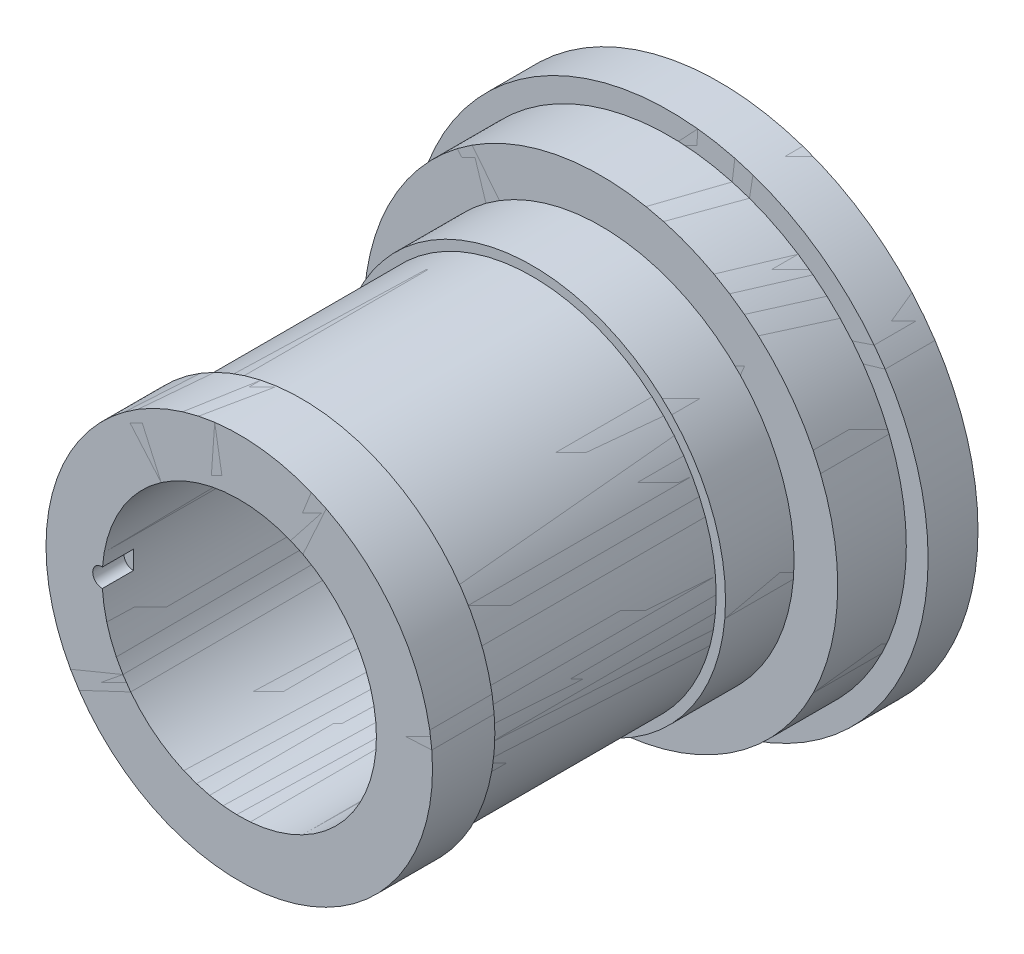
ISO-10303-21;
HEADER;
FILE_DESCRIPTION(('STEP AP214'),'2;1');
FILE_NAME('part.step','',(''),(''),'','','');
FILE_SCHEMA(('AUTOMOTIVE_DESIGN { 1 0 10303 214 1 1 1 1 }'));
ENDSEC;
DATA;
#1=APPLICATION_CONTEXT('core data for automotive mechanical design processes');
#2=APPLICATION_PROTOCOL_DEFINITION('international standard','automotive_design',2000,#1);
#3=PRODUCT_CONTEXT('',#1,'mechanical');
#4=PRODUCT('Part','Part','',(#3));
#5=PRODUCT_RELATED_PRODUCT_CATEGORY('part','',(#4));
#6=PRODUCT_DEFINITION_FORMATION('','',#4);
#7=PRODUCT_DEFINITION_CONTEXT('part definition',#1,'design');
#8=PRODUCT_DEFINITION('design','',#6,#7);
#9=PRODUCT_DEFINITION_SHAPE('','',#8);
#10=(LENGTH_UNIT() NAMED_UNIT(*) SI_UNIT(.MILLI.,.METRE.));
#11=(NAMED_UNIT(*) PLANE_ANGLE_UNIT() SI_UNIT($,.RADIAN.));
#12=(NAMED_UNIT(*) SI_UNIT($,.STERADIAN.) SOLID_ANGLE_UNIT());
#13=UNCERTAINTY_MEASURE_WITH_UNIT(LENGTH_MEASURE(1.E-05),#10,'distance_accuracy_value','');
#14=(GEOMETRIC_REPRESENTATION_CONTEXT(3) GLOBAL_UNCERTAINTY_ASSIGNED_CONTEXT((#13)) GLOBAL_UNIT_ASSIGNED_CONTEXT((#10,
#11,#12)) REPRESENTATION_CONTEXT('',''));
#15=CARTESIAN_POINT('',(0.,0.,0.));
#16=DIRECTION('',(0.,0.,1.));
#17=DIRECTION('',(1.,0.,0.));
#18=AXIS2_PLACEMENT_3D('',#15,#16,#17);
#19=CARTESIAN_POINT('',(-22.0000000000001,0.,-77.));
#20=DIRECTION('',(0.,0.,1.));
#21=DIRECTION('',(1.,0.,0.));
#22=AXIS2_PLACEMENT_3D('',#19,#20,#21);
#23=PLANE('',#22);
#24=CARTESIAN_POINT('',(0.,0.,-77.));
#25=DIRECTION('',(0.,0.,1.));
#26=DIRECTION('',(1.,0.,0.));
#27=AXIS2_PLACEMENT_3D('',#24,#25,#26);
#28=CIRCLE('',#27,41.5);
#29=CARTESIAN_POINT('',(41.5000000000001,0.,-77.));
#30=VERTEX_POINT('',#29);
#31=EDGE_CURVE('E91',#30,#30,#28,.T.);
#32=ORIENTED_EDGE('',*,*,#31,.F.);
#33=EDGE_LOOP('',(#32));
#34=FACE_BOUND('',#33,.T.);
#35=CARTESIAN_POINT('',(0.,0.,-77.));
#36=DIRECTION('',(0.,0.,1.));
#37=DIRECTION('',(1.,0.,0.));
#38=AXIS2_PLACEMENT_3D('',#35,#36,#37);
#39=CIRCLE('',#38,22.);
#40=CARTESIAN_POINT('',(22.,0.,-77.));
#41=VERTEX_POINT('',#40);
#42=EDGE_CURVE('E14',#41,#41,#39,.T.);
#43=ORIENTED_EDGE('',*,*,#42,.T.);
#44=EDGE_LOOP('',(#43));
#45=FACE_BOUND('',#44,.T.);
#46=ADVANCED_FACE('F56',(#34,#45),#23,.F.);
#47=CARTESIAN_POINT('',(0.,0.,0.));
#48=DIRECTION('',(0.,0.,1.));
#49=DIRECTION('',(1.,0.,0.));
#50=AXIS2_PLACEMENT_3D('',#47,#48,#49);
#51=CYLINDRICAL_SURFACE('',#50,22.);
#52=ORIENTED_EDGE('',*,*,#42,.F.);
#53=EDGE_LOOP('',(#52));
#54=FACE_BOUND('',#53,.T.);
#55=CARTESIAN_POINT('',(0.,0.,-5.));
#56=DIRECTION('',(0.,0.,-1.));
#57=DIRECTION('',(1.,0.,0.));
#58=AXIS2_PLACEMENT_3D('',#55,#56,#57);
#59=CIRCLE('',#58,22.);
#60=CARTESIAN_POINT('',(-21.958526324268,-1.35023022719472,-4.99999999999999));
#61=VERTEX_POINT('',#60);
#62=CARTESIAN_POINT('',(-21.9382185648473,1.6475940643827,-4.99999999999999));
#63=VERTEX_POINT('',#62);
#64=EDGE_CURVE('E86',#61,#63,#59,.T.);
#65=ORIENTED_EDGE('',*,*,#64,.F.);
#66=DIRECTION('',(0.,0.,1.));
#67=VECTOR('',#66,1.);
#68=CARTESIAN_POINT('',(-21.958526324268,-1.35023022719472,-4.99999999999999));
#69=LINE('',#68,#67);
#70=CARTESIAN_POINT('',(-21.958526324268,-1.35023022719472,0.));
#71=VERTEX_POINT('',#70);
#72=EDGE_CURVE('E76',#61,#71,#69,.T.);
#73=ORIENTED_EDGE('',*,*,#72,.T.);
#74=CARTESIAN_POINT('',(0.,0.,0.));
#75=DIRECTION('',(0.,0.,1.));
#76=DIRECTION('',(1.,0.,0.));
#77=AXIS2_PLACEMENT_3D('',#74,#75,#76);
#78=CIRCLE('',#77,22.);
#79=CARTESIAN_POINT('',(-21.9382185648473,1.6475940643827,0.));
#80=VERTEX_POINT('',#79);
#81=EDGE_CURVE('E63',#71,#80,#78,.T.);
#82=ORIENTED_EDGE('',*,*,#81,.T.);
#83=DIRECTION('',(0.,0.,1.));
#84=VECTOR('',#83,1.);
#85=CARTESIAN_POINT('',(-21.9382185648473,1.6475940643827,-4.99999999999999));
#86=LINE('',#85,#84);
#87=EDGE_CURVE('E70',#63,#80,#86,.T.);
#88=ORIENTED_EDGE('',*,*,#87,.F.);
#89=EDGE_LOOP('',(#65,#73,#82,#88));
#90=FACE_BOUND('',#89,.T.);
#91=ADVANCED_FACE('F90',(#54,#90),#51,.F.);
#92=CARTESIAN_POINT('',(-22.0000000000001,0.,0.));
#93=DIRECTION('',(0.,0.,-1.));
#94=DIRECTION('',(-1.,0.,0.));
#95=AXIS2_PLACEMENT_3D('',#92,#93,#94);
#96=PLANE('',#95);
#97=ORIENTED_EDGE('',*,*,#81,.F.);
#98=CARTESIAN_POINT('',(-22.004578609375,0.149062668485328,0.));
#99=DIRECTION('',(0.,0.,1.));
#100=DIRECTION('',(1.,0.,0.));
#101=AXIS2_PLACEMENT_3D('',#98,#99,#100);
#102=CIRCLE('',#101,1.5);
#103=EDGE_CURVE('E81',#80,#71,#102,.T.);
#104=ORIENTED_EDGE('',*,*,#103,.F.);
#105=EDGE_LOOP('',(#97,#104));
#106=FACE_BOUND('',#105,.T.);
#107=CARTESIAN_POINT('',(0.,0.,0.));
#108=DIRECTION('',(0.,0.,1.));
#109=DIRECTION('',(1.,0.,0.));
#110=AXIS2_PLACEMENT_3D('',#107,#108,#109);
#111=CIRCLE('',#110,31.);
#112=CARTESIAN_POINT('',(31.,0.,0.));
#113=VERTEX_POINT('',#112);
#114=EDGE_CURVE('E95',#113,#113,#111,.T.);
#115=ORIENTED_EDGE('',*,*,#114,.T.);
#116=EDGE_LOOP('',(#115));
#117=FACE_BOUND('',#116,.T.);
#118=ADVANCED_FACE('F93',(#106,#117),#96,.F.);
#119=CARTESIAN_POINT('',(0.,0.,0.));
#120=DIRECTION('',(0.,0.,1.));
#121=DIRECTION('',(1.,0.,0.));
#122=AXIS2_PLACEMENT_3D('',#119,#120,#121);
#123=CYLINDRICAL_SURFACE('',#122,31.);
#124=ORIENTED_EDGE('',*,*,#114,.F.);
#125=EDGE_LOOP('',(#124));
#126=FACE_BOUND('',#125,.T.);
#127=CARTESIAN_POINT('',(0.,0.,-10.));
#128=DIRECTION('',(0.,0.,1.));
#129=DIRECTION('',(1.,0.,0.));
#130=AXIS2_PLACEMENT_3D('',#127,#128,#129);
#131=CIRCLE('',#130,31.);
#132=CARTESIAN_POINT('',(31.,0.,-10.));
#133=VERTEX_POINT('',#132);
#134=EDGE_CURVE('E97',#133,#133,#131,.T.);
#135=ORIENTED_EDGE('',*,*,#134,.T.);
#136=EDGE_LOOP('',(#135));
#137=FACE_BOUND('',#136,.T.);
#138=ADVANCED_FACE('F181',(#126,#137),#123,.T.);
#139=CARTESIAN_POINT('',(-29.5000000000001,0.,-10.));
#140=DIRECTION('',(0.,0.,1.));
#141=DIRECTION('',(1.,0.,0.));
#142=AXIS2_PLACEMENT_3D('',#139,#140,#141);
#143=PLANE('',#142);
#144=ORIENTED_EDGE('',*,*,#134,.F.);
#145=EDGE_LOOP('',(#144));
#146=FACE_BOUND('',#145,.T.);
#147=CARTESIAN_POINT('',(0.,0.,-10.));
#148=DIRECTION('',(0.,0.,1.));
#149=DIRECTION('',(1.,0.,0.));
#150=AXIS2_PLACEMENT_3D('',#147,#148,#149);
#151=CIRCLE('',#150,29.5);
#152=CARTESIAN_POINT('',(29.5,0.,-10.));
#153=VERTEX_POINT('',#152);
#154=EDGE_CURVE('E102',#153,#153,#151,.T.);
#155=ORIENTED_EDGE('',*,*,#154,.T.);
#156=EDGE_LOOP('',(#155));
#157=FACE_BOUND('',#156,.T.);
#158=ADVANCED_FACE('F177',(#146,#157),#143,.F.);
#159=CARTESIAN_POINT('',(0.,0.,0.));
#160=DIRECTION('',(0.,0.,1.));
#161=DIRECTION('',(1.,0.,0.));
#162=AXIS2_PLACEMENT_3D('',#159,#160,#161);
#163=CYLINDRICAL_SURFACE('',#162,29.5);
#164=ORIENTED_EDGE('',*,*,#154,.F.);
#165=EDGE_LOOP('',(#164));
#166=FACE_BOUND('',#165,.T.);
#167=CARTESIAN_POINT('',(0.,0.,-47.));
#168=DIRECTION('',(0.,0.,1.));
#169=DIRECTION('',(1.,0.,0.));
#170=AXIS2_PLACEMENT_3D('',#167,#168,#169);
#171=CIRCLE('',#170,29.5);
#172=CARTESIAN_POINT('',(29.5,0.,-47.));
#173=VERTEX_POINT('',#172);
#174=EDGE_CURVE('E105',#173,#173,#171,.T.);
#175=ORIENTED_EDGE('',*,*,#174,.T.);
#176=EDGE_LOOP('',(#175));
#177=FACE_BOUND('',#176,.T.);
#178=ADVANCED_FACE('F173',(#166,#177),#163,.T.);
#179=CARTESIAN_POINT('',(-29.5000000000001,0.,-47.));
#180=DIRECTION('',(0.,0.,-1.));
#181=DIRECTION('',(-1.,0.,0.));
#182=AXIS2_PLACEMENT_3D('',#179,#180,#181);
#183=PLANE('',#182);
#184=ORIENTED_EDGE('',*,*,#174,.F.);
#185=EDGE_LOOP('',(#184));
#186=FACE_BOUND('',#185,.T.);
#187=CARTESIAN_POINT('',(0.,0.,-47.));
#188=DIRECTION('',(0.,0.,1.));
#189=DIRECTION('',(1.,0.,0.));
#190=AXIS2_PLACEMENT_3D('',#187,#188,#189);
#191=CIRCLE('',#190,31.);
#192=CARTESIAN_POINT('',(31.,0.,-47.));
#193=VERTEX_POINT('',#192);
#194=EDGE_CURVE('E108',#193,#193,#191,.T.);
#195=ORIENTED_EDGE('',*,*,#194,.T.);
#196=EDGE_LOOP('',(#195));
#197=FACE_BOUND('',#196,.T.);
#198=ADVANCED_FACE('F169',(#186,#197),#183,.F.);
#199=CARTESIAN_POINT('',(0.,0.,0.));
#200=DIRECTION('',(0.,0.,1.));
#201=DIRECTION('',(1.,0.,0.));
#202=AXIS2_PLACEMENT_3D('',#199,#200,#201);
#203=CYLINDRICAL_SURFACE('',#202,31.);
#204=ORIENTED_EDGE('',*,*,#194,.F.);
#205=EDGE_LOOP('',(#204));
#206=FACE_BOUND('',#205,.T.);
#207=CARTESIAN_POINT('',(0.,0.,-58.));
#208=DIRECTION('',(0.,0.,1.));
#209=DIRECTION('',(1.,0.,0.));
#210=AXIS2_PLACEMENT_3D('',#207,#208,#209);
#211=CIRCLE('',#210,31.);
#212=CARTESIAN_POINT('',(31.,0.,-58.));
#213=VERTEX_POINT('',#212);
#214=EDGE_CURVE('E111',#213,#213,#211,.T.);
#215=ORIENTED_EDGE('',*,*,#214,.T.);
#216=EDGE_LOOP('',(#215));
#217=FACE_BOUND('',#216,.T.);
#218=ADVANCED_FACE('F165',(#206,#217),#203,.T.);
#219=CARTESIAN_POINT('',(-31.0000000000001,1.94289029309402E-13,-58.));
#220=DIRECTION('',(0.,0.,-1.));
#221=DIRECTION('',(-1.,0.,0.));
#222=AXIS2_PLACEMENT_3D('',#219,#220,#221);
#223=PLANE('',#222);
#224=ORIENTED_EDGE('',*,*,#214,.F.);
#225=EDGE_LOOP('',(#224));
#226=FACE_BOUND('',#225,.T.);
#227=CARTESIAN_POINT('',(0.,0.,-58.));
#228=DIRECTION('',(0.,0.,1.));
#229=DIRECTION('',(1.,0.,0.));
#230=AXIS2_PLACEMENT_3D('',#227,#228,#229);
#231=CIRCLE('',#230,38.);
#232=CARTESIAN_POINT('',(38.0000000000001,0.,-58.));
#233=VERTEX_POINT('',#232);
#234=EDGE_CURVE('E114',#233,#233,#231,.T.);
#235=ORIENTED_EDGE('',*,*,#234,.T.);
#236=EDGE_LOOP('',(#235));
#237=FACE_BOUND('',#236,.T.);
#238=ADVANCED_FACE('F161',(#226,#237),#223,.F.);
#239=CARTESIAN_POINT('',(0.,0.,0.));
#240=DIRECTION('',(0.,0.,1.));
#241=DIRECTION('',(1.,0.,0.));
#242=AXIS2_PLACEMENT_3D('',#239,#240,#241);
#243=CYLINDRICAL_SURFACE('',#242,38.);
#244=ORIENTED_EDGE('',*,*,#234,.F.);
#245=EDGE_LOOP('',(#244));
#246=FACE_BOUND('',#245,.T.);
#247=CARTESIAN_POINT('',(0.,0.,-69.));
#248=DIRECTION('',(0.,0.,1.));
#249=DIRECTION('',(1.,0.,0.));
#250=AXIS2_PLACEMENT_3D('',#247,#248,#249);
#251=CIRCLE('',#250,38.);
#252=CARTESIAN_POINT('',(38.0000000000001,0.,-69.));
#253=VERTEX_POINT('',#252);
#254=EDGE_CURVE('E117',#253,#253,#251,.T.);
#255=ORIENTED_EDGE('',*,*,#254,.T.);
#256=EDGE_LOOP('',(#255));
#257=FACE_BOUND('',#256,.T.);
#258=ADVANCED_FACE('F154',(#246,#257),#243,.T.);
#259=CARTESIAN_POINT('',(-38.0000000000001,0.,-69.));
#260=DIRECTION('',(0.,0.,-1.));
#261=DIRECTION('',(-1.,0.,0.));
#262=AXIS2_PLACEMENT_3D('',#259,#260,#261);
#263=PLANE('',#262);
#264=ORIENTED_EDGE('',*,*,#254,.F.);
#265=EDGE_LOOP('',(#264));
#266=FACE_BOUND('',#265,.T.);
#267=CARTESIAN_POINT('',(0.,0.,-69.));
#268=DIRECTION('',(0.,0.,1.));
#269=DIRECTION('',(1.,0.,0.));
#270=AXIS2_PLACEMENT_3D('',#267,#268,#269);
#271=CIRCLE('',#270,41.5);
#272=CARTESIAN_POINT('',(41.5000000000001,0.,-69.));
#273=VERTEX_POINT('',#272);
#274=EDGE_CURVE('E120',#273,#273,#271,.T.);
#275=ORIENTED_EDGE('',*,*,#274,.T.);
#276=EDGE_LOOP('',(#275));
#277=FACE_BOUND('',#276,.T.);
#278=ADVANCED_FACE('F148',(#266,#277),#263,.F.);
#279=CARTESIAN_POINT('',(0.,0.,0.));
#280=DIRECTION('',(0.,0.,1.));
#281=DIRECTION('',(1.,0.,0.));
#282=AXIS2_PLACEMENT_3D('',#279,#280,#281);
#283=CYLINDRICAL_SURFACE('',#282,41.5);
#284=ORIENTED_EDGE('',*,*,#274,.F.);
#285=EDGE_LOOP('',(#284));
#286=FACE_BOUND('',#285,.T.);
#287=ORIENTED_EDGE('',*,*,#31,.T.);
#288=EDGE_LOOP('',(#287));
#289=FACE_BOUND('',#288,.T.);
#290=ADVANCED_FACE('F135',(#286,#289),#283,.T.);
#291=CARTESIAN_POINT('',(-22.004578609375,0.149062668485328,-4.99999999999999));
#292=DIRECTION('',(0.,0.,1.));
#293=DIRECTION('',(1.,0.,0.));
#294=AXIS2_PLACEMENT_3D('',#291,#292,#293);
#295=CYLINDRICAL_SURFACE('',#294,1.5);
#296=ORIENTED_EDGE('',*,*,#103,.T.);
#297=ORIENTED_EDGE('',*,*,#72,.F.);
#298=CARTESIAN_POINT('',(-22.004578609375,0.149062668485328,-4.99999999999999));
#299=DIRECTION('',(0.,0.,1.));
#300=DIRECTION('',(1.,0.,0.));
#301=AXIS2_PLACEMENT_3D('',#298,#299,#300);
#302=CIRCLE('',#301,1.5);
#303=EDGE_CURVE('E125',#63,#61,#302,.T.);
#304=ORIENTED_EDGE('',*,*,#303,.F.);
#305=ORIENTED_EDGE('',*,*,#87,.T.);
#306=EDGE_LOOP('',(#296,#297,#304,#305));
#307=FACE_BOUND('',#306,.T.);
#308=ADVANCED_FACE('F82',(#307),#295,.F.);
#309=CARTESIAN_POINT('',(-11.0022893046876,0.0745313342426501,-5.));
#310=DIRECTION('',(0.,0.,1.));
#311=DIRECTION('',(1.,0.,0.));
#312=AXIS2_PLACEMENT_3D('',#309,#310,#311);
#313=PLANE('',#312);
#314=ORIENTED_EDGE('',*,*,#64,.T.);
#315=ORIENTED_EDGE('',*,*,#303,.T.);
#316=EDGE_LOOP('',(#314,#315));
#317=FACE_BOUND('',#316,.T.);
#318=ADVANCED_FACE('F129',(#317),#313,.T.);
#319=CLOSED_SHELL('',(#46,#91,#118,#138,#158,#178,#198,#218,#238,#258,#278,#290,#308,#318));
#320=MANIFOLD_SOLID_BREP('B2',#319);
#321=CARTESIAN_POINT('',(21.9999999999998,0.,0.));
#322=DIRECTION('',(0.,0.,1.));
#323=DIRECTION('',(1.,0.,0.));
#324=AXIS2_PLACEMENT_3D('',#321,#322,#323);
#325=PLANE('',#324);
#326=CARTESIAN_POINT('',(-22.004578609375,0.149062668485328,0.));
#327=DIRECTION('',(0.,0.,1.));
#328=DIRECTION('',(1.,0.,0.));
#329=AXIS2_PLACEMENT_3D('',#326,#327,#328);
#330=CIRCLE('',#329,1.5);
#331=CARTESIAN_POINT('',(-21.9382185648473,1.6475940643827,0.));
#332=VERTEX_POINT('',#331);
#333=CARTESIAN_POINT('',(-21.958526324268,-1.35023022719472,0.));
#334=VERTEX_POINT('',#333);
#335=EDGE_CURVE('E289',#332,#334,#330,.T.);
#336=ORIENTED_EDGE('',*,*,#335,.F.);
#337=CARTESIAN_POINT('',(0.,0.,0.));
#338=DIRECTION('',(0.,0.,1.));
#339=DIRECTION('',(1.,0.,0.));
#340=AXIS2_PLACEMENT_3D('',#337,#338,#339);
#341=CIRCLE('',#340,22.);
#342=EDGE_CURVE('E298',#334,#332,#341,.T.);
#343=ORIENTED_EDGE('',*,*,#342,.F.);
#344=EDGE_LOOP('',(#336,#343));
#345=FACE_BOUND('',#344,.T.);
#346=CARTESIAN_POINT('',(0.,0.,0.));
#347=DIRECTION('',(0.,0.,1.));
#348=DIRECTION('',(1.,0.,0.));
#349=AXIS2_PLACEMENT_3D('',#346,#347,#348);
#350=CIRCLE('',#349,31.);
#351=CARTESIAN_POINT('',(31.,0.,0.));
#352=VERTEX_POINT('',#351);
#353=EDGE_CURVE('E54',#352,#352,#350,.T.);
#354=ORIENTED_EDGE('',*,*,#353,.T.);
#355=EDGE_LOOP('',(#354));
#356=FACE_BOUND('',#355,.T.);
#357=ADVANCED_FACE('F261',(#345,#356),#325,.T.);
#358=CARTESIAN_POINT('',(0.,0.,0.));
#359=DIRECTION('',(0.,0.,1.));
#360=DIRECTION('',(1.,0.,0.));
#361=AXIS2_PLACEMENT_3D('',#358,#359,#360);
#362=CYLINDRICAL_SURFACE('',#361,31.);
#363=CARTESIAN_POINT('',(0.,0.,-10.));
#364=DIRECTION('',(0.,0.,1.));
#365=DIRECTION('',(1.,0.,0.));
#366=AXIS2_PLACEMENT_3D('',#363,#364,#365);
#367=CIRCLE('',#366,31.);
#368=CARTESIAN_POINT('',(31.,0.,-10.));
#369=VERTEX_POINT('',#368);
#370=EDGE_CURVE('E268',#369,#369,#367,.T.);
#371=ORIENTED_EDGE('',*,*,#370,.T.);
#372=EDGE_LOOP('',(#371));
#373=FACE_BOUND('',#372,.T.);
#374=ORIENTED_EDGE('',*,*,#353,.F.);
#375=EDGE_LOOP('',(#374));
#376=FACE_BOUND('',#375,.T.);
#377=ADVANCED_FACE('F334',(#373,#376),#362,.T.);
#378=CARTESIAN_POINT('',(29.4999999999999,0.,-10.));
#379=DIRECTION('',(0.,0.,-1.));
#380=DIRECTION('',(-1.,0.,0.));
#381=AXIS2_PLACEMENT_3D('',#378,#379,#380);
#382=PLANE('',#381);
#383=CARTESIAN_POINT('',(0.,0.,-10.));
#384=DIRECTION('',(0.,0.,1.));
#385=DIRECTION('',(1.,0.,0.));
#386=AXIS2_PLACEMENT_3D('',#383,#384,#385);
#387=CIRCLE('',#386,29.5);
#388=CARTESIAN_POINT('',(29.5,0.,-10.));
#389=VERTEX_POINT('',#388);
#390=EDGE_CURVE('E329',#389,#389,#387,.T.);
#391=ORIENTED_EDGE('',*,*,#390,.T.);
#392=EDGE_LOOP('',(#391));
#393=FACE_BOUND('',#392,.T.);
#394=ORIENTED_EDGE('',*,*,#370,.F.);
#395=EDGE_LOOP('',(#394));
#396=FACE_BOUND('',#395,.T.);
#397=ADVANCED_FACE('F337',(#393,#396),#382,.T.);
#398=CARTESIAN_POINT('',(0.,0.,0.));
#399=DIRECTION('',(0.,0.,1.));
#400=DIRECTION('',(1.,0.,0.));
#401=AXIS2_PLACEMENT_3D('',#398,#399,#400);
#402=CYLINDRICAL_SURFACE('',#401,29.5);
#403=CARTESIAN_POINT('',(0.,0.,-47.));
#404=DIRECTION('',(0.,0.,1.));
#405=DIRECTION('',(1.,0.,0.));
#406=AXIS2_PLACEMENT_3D('',#403,#404,#405);
#407=CIRCLE('',#406,29.5);
#408=CARTESIAN_POINT('',(29.5,0.,-47.));
#409=VERTEX_POINT('',#408);
#410=EDGE_CURVE('E326',#409,#409,#407,.T.);
#411=ORIENTED_EDGE('',*,*,#410,.T.);
#412=EDGE_LOOP('',(#411));
#413=FACE_BOUND('',#412,.T.);
#414=ORIENTED_EDGE('',*,*,#390,.F.);
#415=EDGE_LOOP('',(#414));
#416=FACE_BOUND('',#415,.T.);
#417=ADVANCED_FACE('F339',(#413,#416),#402,.T.);
#418=CARTESIAN_POINT('',(29.5,0.,-47.));
#419=DIRECTION('',(0.,0.,1.));
#420=DIRECTION('',(1.,0.,0.));
#421=AXIS2_PLACEMENT_3D('',#418,#419,#420);
#422=PLANE('',#421);
#423=CARTESIAN_POINT('',(0.,0.,-47.));
#424=DIRECTION('',(0.,0.,1.));
#425=DIRECTION('',(1.,0.,0.));
#426=AXIS2_PLACEMENT_3D('',#423,#424,#425);
#427=CIRCLE('',#426,31.);
#428=CARTESIAN_POINT('',(31.,0.,-47.));
#429=VERTEX_POINT('',#428);
#430=EDGE_CURVE('E323',#429,#429,#427,.T.);
#431=ORIENTED_EDGE('',*,*,#430,.T.);
#432=EDGE_LOOP('',(#431));
#433=FACE_BOUND('',#432,.T.);
#434=ORIENTED_EDGE('',*,*,#410,.F.);
#435=EDGE_LOOP('',(#434));
#436=FACE_BOUND('',#435,.T.);
#437=ADVANCED_FACE('F346',(#433,#436),#422,.T.);
#438=CARTESIAN_POINT('',(0.,0.,0.));
#439=DIRECTION('',(0.,0.,1.));
#440=DIRECTION('',(1.,0.,0.));
#441=AXIS2_PLACEMENT_3D('',#438,#439,#440);
#442=CYLINDRICAL_SURFACE('',#441,31.);
#443=CARTESIAN_POINT('',(0.,0.,-58.));
#444=DIRECTION('',(0.,0.,1.));
#445=DIRECTION('',(1.,0.,0.));
#446=AXIS2_PLACEMENT_3D('',#443,#444,#445);
#447=CIRCLE('',#446,31.);
#448=CARTESIAN_POINT('',(31.,0.,-58.));
#449=VERTEX_POINT('',#448);
#450=EDGE_CURVE('E320',#449,#449,#447,.T.);
#451=ORIENTED_EDGE('',*,*,#450,.T.);
#452=EDGE_LOOP('',(#451));
#453=FACE_BOUND('',#452,.T.);
#454=ORIENTED_EDGE('',*,*,#430,.F.);
#455=EDGE_LOOP('',(#454));
#456=FACE_BOUND('',#455,.T.);
#457=ADVANCED_FACE('F369',(#453,#456),#442,.T.);
#458=CARTESIAN_POINT('',(31.,0.,-58.));
#459=DIRECTION('',(0.,0.,1.));
#460=DIRECTION('',(1.,0.,0.));
#461=AXIS2_PLACEMENT_3D('',#458,#459,#460);
#462=PLANE('',#461);
#463=CARTESIAN_POINT('',(0.,0.,-58.));
#464=DIRECTION('',(0.,0.,1.));
#465=DIRECTION('',(1.,0.,0.));
#466=AXIS2_PLACEMENT_3D('',#463,#464,#465);
#467=CIRCLE('',#466,38.);
#468=CARTESIAN_POINT('',(38.0000000000001,0.,-58.));
#469=VERTEX_POINT('',#468);
#470=EDGE_CURVE('E317',#469,#469,#467,.T.);
#471=ORIENTED_EDGE('',*,*,#470,.T.);
#472=EDGE_LOOP('',(#471));
#473=FACE_BOUND('',#472,.T.);
#474=ORIENTED_EDGE('',*,*,#450,.F.);
#475=EDGE_LOOP('',(#474));
#476=FACE_BOUND('',#475,.T.);
#477=ADVANCED_FACE('F377',(#473,#476),#462,.T.);
#478=CARTESIAN_POINT('',(0.,0.,0.));
#479=DIRECTION('',(0.,0.,1.));
#480=DIRECTION('',(1.,0.,0.));
#481=AXIS2_PLACEMENT_3D('',#478,#479,#480);
#482=CYLINDRICAL_SURFACE('',#481,38.);
#483=CARTESIAN_POINT('',(0.,0.,-69.));
#484=DIRECTION('',(0.,0.,1.));
#485=DIRECTION('',(1.,0.,0.));
#486=AXIS2_PLACEMENT_3D('',#483,#484,#485);
#487=CIRCLE('',#486,38.);
#488=CARTESIAN_POINT('',(38.0000000000001,0.,-69.));
#489=VERTEX_POINT('',#488);
#490=EDGE_CURVE('E314',#489,#489,#487,.T.);
#491=ORIENTED_EDGE('',*,*,#490,.T.);
#492=EDGE_LOOP('',(#491));
#493=FACE_BOUND('',#492,.T.);
#494=ORIENTED_EDGE('',*,*,#470,.F.);
#495=EDGE_LOOP('',(#494));
#496=FACE_BOUND('',#495,.T.);
#497=ADVANCED_FACE('F385',(#493,#496),#482,.T.);
#498=CARTESIAN_POINT('',(37.9999999999999,0.,-69.));
#499=DIRECTION('',(0.,0.,1.));
#500=DIRECTION('',(1.,0.,0.));
#501=AXIS2_PLACEMENT_3D('',#498,#499,#500);
#502=PLANE('',#501);
#503=CARTESIAN_POINT('',(0.,0.,-69.));
#504=DIRECTION('',(0.,0.,1.));
#505=DIRECTION('',(1.,0.,0.));
#506=AXIS2_PLACEMENT_3D('',#503,#504,#505);
#507=CIRCLE('',#506,41.5);
#508=CARTESIAN_POINT('',(41.5000000000001,0.,-69.));
#509=VERTEX_POINT('',#508);
#510=EDGE_CURVE('E311',#509,#509,#507,.T.);
#511=ORIENTED_EDGE('',*,*,#510,.T.);
#512=EDGE_LOOP('',(#511));
#513=FACE_BOUND('',#512,.T.);
#514=ORIENTED_EDGE('',*,*,#490,.F.);
#515=EDGE_LOOP('',(#514));
#516=FACE_BOUND('',#515,.T.);
#517=ADVANCED_FACE('F393',(#513,#516),#502,.T.);
#518=CARTESIAN_POINT('',(0.,0.,0.));
#519=DIRECTION('',(0.,0.,1.));
#520=DIRECTION('',(1.,0.,0.));
#521=AXIS2_PLACEMENT_3D('',#518,#519,#520);
#522=CYLINDRICAL_SURFACE('',#521,41.5);
#523=CARTESIAN_POINT('',(0.,0.,-77.));
#524=DIRECTION('',(0.,0.,1.));
#525=DIRECTION('',(1.,0.,0.));
#526=AXIS2_PLACEMENT_3D('',#523,#524,#525);
#527=CIRCLE('',#526,41.5);
#528=CARTESIAN_POINT('',(41.5000000000001,0.,-77.));
#529=VERTEX_POINT('',#528);
#530=EDGE_CURVE('E305',#529,#529,#527,.T.);
#531=ORIENTED_EDGE('',*,*,#530,.T.);
#532=EDGE_LOOP('',(#531));
#533=FACE_BOUND('',#532,.T.);
#534=ORIENTED_EDGE('',*,*,#510,.F.);
#535=EDGE_LOOP('',(#534));
#536=FACE_BOUND('',#535,.T.);
#537=ADVANCED_FACE('F401',(#533,#536),#522,.T.);
#538=CARTESIAN_POINT('',(22.,0.,-77.));
#539=DIRECTION('',(0.,0.,-1.));
#540=DIRECTION('',(-1.,0.,0.));
#541=AXIS2_PLACEMENT_3D('',#538,#539,#540);
#542=PLANE('',#541);
#543=CARTESIAN_POINT('',(0.,0.,-77.));
#544=DIRECTION('',(0.,0.,1.));
#545=DIRECTION('',(1.,0.,0.));
#546=AXIS2_PLACEMENT_3D('',#543,#544,#545);
#547=CIRCLE('',#546,22.);
#548=CARTESIAN_POINT('',(22.,0.,-77.));
#549=VERTEX_POINT('',#548);
#550=EDGE_CURVE('E302',#549,#549,#547,.T.);
#551=ORIENTED_EDGE('',*,*,#550,.T.);
#552=EDGE_LOOP('',(#551));
#553=FACE_BOUND('',#552,.T.);
#554=ORIENTED_EDGE('',*,*,#530,.F.);
#555=EDGE_LOOP('',(#554));
#556=FACE_BOUND('',#555,.T.);
#557=ADVANCED_FACE('F409',(#553,#556),#542,.T.);
#558=CARTESIAN_POINT('',(0.,0.,0.));
#559=DIRECTION('',(0.,0.,1.));
#560=DIRECTION('',(1.,0.,0.));
#561=AXIS2_PLACEMENT_3D('',#558,#559,#560);
#562=CYLINDRICAL_SURFACE('',#561,22.);
#563=DIRECTION('',(0.,0.,1.));
#564=VECTOR('',#563,1.);
#565=CARTESIAN_POINT('',(-21.958526324268,-1.35023022719472,-4.99999999999999));
#566=LINE('',#565,#564);
#567=CARTESIAN_POINT('',(-21.958526324268,-1.35023022719472,-4.99999999999999));
#568=VERTEX_POINT('',#567);
#569=EDGE_CURVE('E293',#568,#334,#566,.T.);
#570=ORIENTED_EDGE('',*,*,#569,.T.);
#571=ORIENTED_EDGE('',*,*,#342,.T.);
#572=DIRECTION('',(0.,0.,1.));
#573=VECTOR('',#572,1.);
#574=CARTESIAN_POINT('',(-21.9382185648473,1.6475940643827,-4.99999999999999));
#575=LINE('',#574,#573);
#576=CARTESIAN_POINT('',(-21.9382185648473,1.6475940643827,-4.99999999999999));
#577=VERTEX_POINT('',#576);
#578=EDGE_CURVE('E286',#577,#332,#575,.T.);
#579=ORIENTED_EDGE('',*,*,#578,.F.);
#580=CARTESIAN_POINT('',(0.,0.,-5.));
#581=DIRECTION('',(0.,0.,-1.));
#582=DIRECTION('',(1.,0.,0.));
#583=AXIS2_PLACEMENT_3D('',#580,#581,#582);
#584=CIRCLE('',#583,22.);
#585=EDGE_CURVE('E279',#568,#577,#584,.T.);
#586=ORIENTED_EDGE('',*,*,#585,.F.);
#587=EDGE_LOOP('',(#570,#571,#579,#586));
#588=FACE_BOUND('',#587,.T.);
#589=ORIENTED_EDGE('',*,*,#550,.F.);
#590=EDGE_LOOP('',(#589));
#591=FACE_BOUND('',#590,.T.);
#592=ADVANCED_FACE('F300',(#588,#591),#562,.F.);
#593=CARTESIAN_POINT('',(-22.004578609375,0.149062668485328,-4.99999999999999));
#594=DIRECTION('',(0.,0.,1.));
#595=DIRECTION('',(1.,0.,0.));
#596=AXIS2_PLACEMENT_3D('',#593,#594,#595);
#597=CYLINDRICAL_SURFACE('',#596,1.5);
#598=ORIENTED_EDGE('',*,*,#335,.T.);
#599=ORIENTED_EDGE('',*,*,#569,.F.);
#600=CARTESIAN_POINT('',(-22.004578609375,0.149062668485328,-4.99999999999999));
#601=DIRECTION('',(0.,0.,1.));
#602=DIRECTION('',(1.,0.,0.));
#603=AXIS2_PLACEMENT_3D('',#600,#601,#602);
#604=CIRCLE('',#603,1.5);
#605=EDGE_CURVE('E274',#577,#568,#604,.T.);
#606=ORIENTED_EDGE('',*,*,#605,.F.);
#607=ORIENTED_EDGE('',*,*,#578,.T.);
#608=EDGE_LOOP('',(#598,#599,#606,#607));
#609=FACE_BOUND('',#608,.T.);
#610=ADVANCED_FACE('F288',(#609),#597,.F.);
#611=CARTESIAN_POINT('',(-11.0022893046876,0.0745313342426501,-5.));
#612=DIRECTION('',(0.,0.,1.));
#613=DIRECTION('',(1.,0.,0.));
#614=AXIS2_PLACEMENT_3D('',#611,#612,#613);
#615=PLANE('',#614);
#616=ORIENTED_EDGE('',*,*,#585,.T.);
#617=ORIENTED_EDGE('',*,*,#605,.T.);
#618=EDGE_LOOP('',(#616,#617));
#619=FACE_BOUND('',#618,.T.);
#620=ADVANCED_FACE('F430',(#619),#615,.T.);
#621=CLOSED_SHELL('',(#357,#377,#397,#417,#437,#457,#477,#497,#517,#537,#557,#592,#610,#620));
#622=MANIFOLD_SOLID_BREP('B8',#621);
#623=ADVANCED_BREP_SHAPE_REPRESENTATION('',(#18,#320,#622),#14);
#624=SHAPE_DEFINITION_REPRESENTATION(#9,#623);
ENDSEC;
END-ISO-10303-21;
